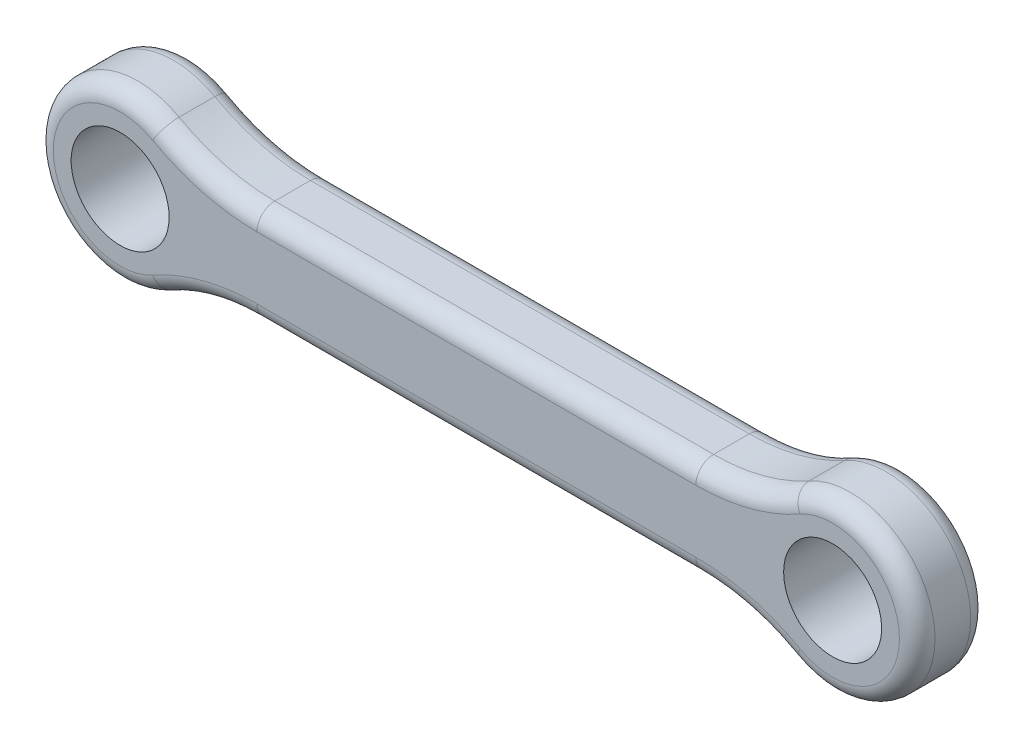
ISO-10303-21;
HEADER;
FILE_DESCRIPTION(('STEP AP214'),'2;1');
FILE_NAME('part.step','',(''),(''),'','','');
FILE_SCHEMA(('AUTOMOTIVE_DESIGN { 1 0 10303 214 1 1 1 1 }'));
ENDSEC;
DATA;
#1=APPLICATION_CONTEXT('core data for automotive mechanical design processes');
#2=APPLICATION_PROTOCOL_DEFINITION('international standard','automotive_design',2000,#1);
#3=PRODUCT_CONTEXT('',#1,'mechanical');
#4=PRODUCT('Part','Part','',(#3));
#5=PRODUCT_RELATED_PRODUCT_CATEGORY('part','',(#4));
#6=PRODUCT_DEFINITION_FORMATION('','',#4);
#7=PRODUCT_DEFINITION_CONTEXT('part definition',#1,'design');
#8=PRODUCT_DEFINITION('design','',#6,#7);
#9=PRODUCT_DEFINITION_SHAPE('','',#8);
#10=(LENGTH_UNIT() NAMED_UNIT(*) SI_UNIT(.MILLI.,.METRE.));
#11=(NAMED_UNIT(*) PLANE_ANGLE_UNIT() SI_UNIT($,.RADIAN.));
#12=(NAMED_UNIT(*) SI_UNIT($,.STERADIAN.) SOLID_ANGLE_UNIT());
#13=UNCERTAINTY_MEASURE_WITH_UNIT(LENGTH_MEASURE(1.E-05),#10,'distance_accuracy_value','');
#14=(GEOMETRIC_REPRESENTATION_CONTEXT(3) GLOBAL_UNCERTAINTY_ASSIGNED_CONTEXT((#13)) GLOBAL_UNIT_ASSIGNED_CONTEXT((#10,
#11,#12)) REPRESENTATION_CONTEXT('',''));
#15=CARTESIAN_POINT('',(0.,0.,0.));
#16=DIRECTION('',(0.,0.,1.));
#17=DIRECTION('',(1.,0.,0.));
#18=AXIS2_PLACEMENT_3D('',#15,#16,#17);
#19=CARTESIAN_POINT('',(12.3188542521314,-13.75,4.));
#20=DIRECTION('',(0.,0.,-1.));
#21=DIRECTION('',(-1.,0.,0.));
#22=AXIS2_PLACEMENT_3D('',#19,#20,#21);
#23=PLANE('',#22);
#24=DIRECTION('',(1.,0.,0.));
#25=VECTOR('',#24,1.);
#26=CARTESIAN_POINT('',(-12.3188542521314,1.75,4.));
#27=LINE('',#26,#25);
#28=CARTESIAN_POINT('',(12.3188542521314,1.75,4.));
#29=VERTEX_POINT('',#28);
#30=CARTESIAN_POINT('',(-12.3188542521314,1.75,4.));
#31=VERTEX_POINT('',#30);
#32=EDGE_CURVE('E218',#29,#31,#27,.F.);
#33=ORIENTED_EDGE('',*,*,#32,.T.);
#34=CARTESIAN_POINT('',(-12.3188542521314,13.75,4.));
#35=DIRECTION('',(0.,0.,-1.));
#36=DIRECTION('',(-1.,0.,0.));
#37=AXIS2_PLACEMENT_3D('',#34,#35,#36);
#38=CIRCLE('',#37,12.);
#39=CARTESIAN_POINT('',(-18.171155774317,3.27380952380952,4.));
#40=VERTEX_POINT('',#39);
#41=EDGE_CURVE('E264',#31,#40,#38,.T.);
#42=ORIENTED_EDGE('',*,*,#41,.T.);
#43=CARTESIAN_POINT('',(-20.,0.,4.));
#44=DIRECTION('',(0.,0.,-1.));
#45=DIRECTION('',(-1.,0.,0.));
#46=AXIS2_PLACEMENT_3D('',#43,#44,#45);
#47=CIRCLE('',#46,3.75);
#48=CARTESIAN_POINT('',(-18.171155774317,-3.27380952380952,4.));
#49=VERTEX_POINT('',#48);
#50=EDGE_CURVE('E261',#40,#49,#47,.F.);
#51=ORIENTED_EDGE('',*,*,#50,.T.);
#52=CARTESIAN_POINT('',(-12.3188542521314,-13.75,4.));
#53=DIRECTION('',(0.,0.,-1.));
#54=DIRECTION('',(-1.,0.,0.));
#55=AXIS2_PLACEMENT_3D('',#52,#53,#54);
#56=CIRCLE('',#55,12.);
#57=CARTESIAN_POINT('',(-12.3188542521314,-1.75,4.));
#58=VERTEX_POINT('',#57);
#59=EDGE_CURVE('E258',#49,#58,#56,.T.);
#60=ORIENTED_EDGE('',*,*,#59,.T.);
#61=DIRECTION('',(1.,0.,0.));
#62=VECTOR('',#61,1.);
#63=CARTESIAN_POINT('',(12.3188542521314,-1.75,4.));
#64=LINE('',#63,#62);
#65=CARTESIAN_POINT('',(12.3188542521314,-1.75,4.));
#66=VERTEX_POINT('',#65);
#67=EDGE_CURVE('E255',#58,#66,#64,.T.);
#68=ORIENTED_EDGE('',*,*,#67,.T.);
#69=CARTESIAN_POINT('',(12.3188542521314,-13.75,4.));
#70=DIRECTION('',(0.,0.,-1.));
#71=DIRECTION('',(-1.,0.,0.));
#72=AXIS2_PLACEMENT_3D('',#69,#70,#71);
#73=CIRCLE('',#72,12.);
#74=CARTESIAN_POINT('',(18.171155774317,-3.27380952380952,4.));
#75=VERTEX_POINT('',#74);
#76=EDGE_CURVE('E252',#66,#75,#73,.T.);
#77=ORIENTED_EDGE('',*,*,#76,.T.);
#78=CARTESIAN_POINT('',(20.,0.,4.));
#79=DIRECTION('',(0.,0.,-1.));
#80=DIRECTION('',(-1.,0.,0.));
#81=AXIS2_PLACEMENT_3D('',#78,#79,#80);
#82=CIRCLE('',#81,3.75);
#83=CARTESIAN_POINT('',(18.171155774317,3.27380952380952,4.));
#84=VERTEX_POINT('',#83);
#85=EDGE_CURVE('E221',#75,#84,#82,.F.);
#86=ORIENTED_EDGE('',*,*,#85,.T.);
#87=CARTESIAN_POINT('',(12.3188542521314,13.75,4.));
#88=DIRECTION('',(0.,0.,-1.));
#89=DIRECTION('',(-1.,0.,0.));
#90=AXIS2_PLACEMENT_3D('',#87,#88,#89);
#91=CIRCLE('',#90,12.);
#92=EDGE_CURVE('E213',#84,#29,#91,.T.);
#93=ORIENTED_EDGE('',*,*,#92,.T.);
#94=EDGE_LOOP('',(#33,#42,#51,#60,#68,#77,#86,#93));
#95=FACE_BOUND('',#94,.T.);
#96=CARTESIAN_POINT('',(20.,0.,4.));
#97=DIRECTION('',(0.,0.,-1.));
#98=DIRECTION('',(-1.,0.,0.));
#99=AXIS2_PLACEMENT_3D('',#96,#97,#98);
#100=CIRCLE('',#99,2.75);
#101=CARTESIAN_POINT('',(17.25,0.,4.));
#102=VERTEX_POINT('',#101);
#103=EDGE_CURVE('E713',#102,#102,#100,.T.);
#104=ORIENTED_EDGE('',*,*,#103,.T.);
#105=EDGE_LOOP('',(#104));
#106=FACE_BOUND('',#105,.T.);
#107=CARTESIAN_POINT('',(-20.,0.,4.));
#108=DIRECTION('',(0.,0.,1.));
#109=DIRECTION('',(1.,0.,0.));
#110=AXIS2_PLACEMENT_3D('',#107,#108,#109);
#111=CIRCLE('',#110,2.75);
#112=CARTESIAN_POINT('',(-17.25,0.,4.));
#113=VERTEX_POINT('',#112);
#114=EDGE_CURVE('E707',#113,#113,#111,.T.);
#115=ORIENTED_EDGE('',*,*,#114,.F.);
#116=EDGE_LOOP('',(#115));
#117=FACE_BOUND('',#116,.T.);
#118=ADVANCED_FACE('F99',(#95,#106,#117),#23,.F.);
#119=CARTESIAN_POINT('',(12.3188542521314,-13.75,0.));
#120=DIRECTION('',(0.,0.,-1.));
#121=DIRECTION('',(-1.,0.,0.));
#122=AXIS2_PLACEMENT_3D('',#119,#120,#121);
#123=PLANE('',#122);
#124=CARTESIAN_POINT('',(-20.,0.,0.));
#125=DIRECTION('',(0.,0.,-1.));
#126=DIRECTION('',(-1.,0.,0.));
#127=AXIS2_PLACEMENT_3D('',#124,#125,#126);
#128=CIRCLE('',#127,3.75);
#129=CARTESIAN_POINT('',(-18.171155774317,-3.27380952380952,0.));
#130=VERTEX_POINT('',#129);
#131=CARTESIAN_POINT('',(-18.171155774317,3.27380952380952,0.));
#132=VERTEX_POINT('',#131);
#133=EDGE_CURVE('E117',#130,#132,#128,.T.);
#134=ORIENTED_EDGE('',*,*,#133,.T.);
#135=CARTESIAN_POINT('',(-12.3188542521314,13.75,0.));
#136=DIRECTION('',(0.,0.,-1.));
#137=DIRECTION('',(-1.,0.,0.));
#138=AXIS2_PLACEMENT_3D('',#135,#136,#137);
#139=CIRCLE('',#138,12.);
#140=CARTESIAN_POINT('',(-12.3188542521314,1.75,0.));
#141=VERTEX_POINT('',#140);
#142=EDGE_CURVE('E329',#132,#141,#139,.F.);
#143=ORIENTED_EDGE('',*,*,#142,.T.);
#144=DIRECTION('',(1.,0.,0.));
#145=VECTOR('',#144,1.);
#146=CARTESIAN_POINT('',(12.3188542521314,1.75,0.));
#147=LINE('',#146,#145);
#148=CARTESIAN_POINT('',(12.3188542521314,1.75,0.));
#149=VERTEX_POINT('',#148);
#150=EDGE_CURVE('E310',#141,#149,#147,.T.);
#151=ORIENTED_EDGE('',*,*,#150,.T.);
#152=CARTESIAN_POINT('',(12.3188542521314,13.75,0.));
#153=DIRECTION('',(0.,0.,-1.));
#154=DIRECTION('',(-1.,0.,0.));
#155=AXIS2_PLACEMENT_3D('',#152,#153,#154);
#156=CIRCLE('',#155,12.);
#157=CARTESIAN_POINT('',(18.171155774317,3.27380952380952,0.));
#158=VERTEX_POINT('',#157);
#159=EDGE_CURVE('E313',#149,#158,#156,.F.);
#160=ORIENTED_EDGE('',*,*,#159,.T.);
#161=CARTESIAN_POINT('',(20.,0.,0.));
#162=DIRECTION('',(0.,0.,-1.));
#163=DIRECTION('',(-1.,0.,0.));
#164=AXIS2_PLACEMENT_3D('',#161,#162,#163);
#165=CIRCLE('',#164,3.75);
#166=CARTESIAN_POINT('',(18.171155774317,-3.27380952380952,0.));
#167=VERTEX_POINT('',#166);
#168=EDGE_CURVE('E316',#158,#167,#165,.T.);
#169=ORIENTED_EDGE('',*,*,#168,.T.);
#170=CARTESIAN_POINT('',(12.3188542521314,-13.75,0.));
#171=DIRECTION('',(0.,0.,-1.));
#172=DIRECTION('',(-1.,0.,0.));
#173=AXIS2_PLACEMENT_3D('',#170,#171,#172);
#174=CIRCLE('',#173,12.);
#175=CARTESIAN_POINT('',(12.3188542521314,-1.75,0.));
#176=VERTEX_POINT('',#175);
#177=EDGE_CURVE('E319',#167,#176,#174,.F.);
#178=ORIENTED_EDGE('',*,*,#177,.T.);
#179=DIRECTION('',(1.,0.,0.));
#180=VECTOR('',#179,1.);
#181=CARTESIAN_POINT('',(-12.3188542521314,-1.75,0.));
#182=LINE('',#181,#180);
#183=CARTESIAN_POINT('',(-12.3188542521314,-1.75,0.));
#184=VERTEX_POINT('',#183);
#185=EDGE_CURVE('E322',#176,#184,#182,.F.);
#186=ORIENTED_EDGE('',*,*,#185,.T.);
#187=CARTESIAN_POINT('',(-12.3188542521314,-13.75,0.));
#188=DIRECTION('',(0.,0.,-1.));
#189=DIRECTION('',(-1.,0.,0.));
#190=AXIS2_PLACEMENT_3D('',#187,#188,#189);
#191=CIRCLE('',#190,12.);
#192=EDGE_CURVE('E122',#184,#130,#191,.F.);
#193=ORIENTED_EDGE('',*,*,#192,.T.);
#194=EDGE_LOOP('',(#134,#143,#151,#160,#169,#178,#186,#193));
#195=FACE_BOUND('',#194,.T.);
#196=CARTESIAN_POINT('',(20.,0.,0.));
#197=DIRECTION('',(0.,0.,-1.));
#198=DIRECTION('',(-1.,0.,0.));
#199=AXIS2_PLACEMENT_3D('',#196,#197,#198);
#200=CIRCLE('',#199,2.75);
#201=CARTESIAN_POINT('',(17.25,0.,0.));
#202=VERTEX_POINT('',#201);
#203=EDGE_CURVE('E356',#202,#202,#200,.T.);
#204=ORIENTED_EDGE('',*,*,#203,.F.);
#205=EDGE_LOOP('',(#204));
#206=FACE_BOUND('',#205,.T.);
#207=CARTESIAN_POINT('',(-20.,0.,0.));
#208=DIRECTION('',(0.,0.,1.));
#209=DIRECTION('',(1.,0.,0.));
#210=AXIS2_PLACEMENT_3D('',#207,#208,#209);
#211=CIRCLE('',#210,2.75);
#212=CARTESIAN_POINT('',(-17.25,0.,0.));
#213=VERTEX_POINT('',#212);
#214=EDGE_CURVE('E710',#213,#213,#211,.T.);
#215=ORIENTED_EDGE('',*,*,#214,.T.);
#216=EDGE_LOOP('',(#215));
#217=FACE_BOUND('',#216,.T.);
#218=ADVANCED_FACE('F396',(#195,#206,#217),#123,.T.);
#219=CARTESIAN_POINT('',(-12.3188542521314,-2.75,4.));
#220=DIRECTION('',(0.,1.,0.));
#221=DIRECTION('',(0.,0.,1.));
#222=AXIS2_PLACEMENT_3D('',#219,#220,#221);
#223=PLANE('',#222);
#224=DIRECTION('',(0.,0.,-1.));
#225=VECTOR('',#224,1.);
#226=CARTESIAN_POINT('',(12.3188542521314,-2.75,4.));
#227=LINE('',#226,#225);
#228=CARTESIAN_POINT('',(12.3188542521314,-2.75,3.));
#229=VERTEX_POINT('',#228);
#230=CARTESIAN_POINT('',(12.3188542521314,-2.75,1.));
#231=VERTEX_POINT('',#230);
#232=EDGE_CURVE('E242',#229,#231,#227,.T.);
#233=ORIENTED_EDGE('',*,*,#232,.F.);
#234=DIRECTION('',(1.,0.,0.));
#235=VECTOR('',#234,1.);
#236=CARTESIAN_POINT('',(-12.3188542521314,-2.75,3.));
#237=LINE('',#236,#235);
#238=CARTESIAN_POINT('',(-12.3188542521314,-2.75,3.));
#239=VERTEX_POINT('',#238);
#240=EDGE_CURVE('E290',#229,#239,#237,.F.);
#241=ORIENTED_EDGE('',*,*,#240,.T.);
#242=DIRECTION('',(0.,0.,-1.));
#243=VECTOR('',#242,1.);
#244=CARTESIAN_POINT('',(-12.3188542521314,-2.75,4.));
#245=LINE('',#244,#243);
#246=CARTESIAN_POINT('',(-12.3188542521314,-2.75,1.));
#247=VERTEX_POINT('',#246);
#248=EDGE_CURVE('E717',#239,#247,#245,.T.);
#249=ORIENTED_EDGE('',*,*,#248,.T.);
#250=DIRECTION('',(1.,0.,0.));
#251=VECTOR('',#250,1.);
#252=CARTESIAN_POINT('',(12.3188542521314,-2.75,1.));
#253=LINE('',#252,#251);
#254=EDGE_CURVE('E287',#247,#231,#253,.T.);
#255=ORIENTED_EDGE('',*,*,#254,.T.);
#256=EDGE_LOOP('',(#233,#241,#249,#255));
#257=FACE_BOUND('',#256,.T.);
#258=ADVANCED_FACE('F472',(#257),#223,.F.);
#259=CARTESIAN_POINT('',(12.3188542521314,-13.75,4.));
#260=DIRECTION('',(0.,0.,-1.));
#261=DIRECTION('',(-1.,0.,0.));
#262=AXIS2_PLACEMENT_3D('',#259,#260,#261);
#263=CYLINDRICAL_SURFACE('',#262,11.);
#264=DIRECTION('',(0.,0.,-1.));
#265=VECTOR('',#264,1.);
#266=CARTESIAN_POINT('',(17.6834639808015,-4.1468253968254,4.));
#267=LINE('',#266,#265);
#268=CARTESIAN_POINT('',(17.6834639808015,-4.1468253968254,3.));
#269=VERTEX_POINT('',#268);
#270=CARTESIAN_POINT('',(17.6834639808015,-4.1468253968254,1.));
#271=VERTEX_POINT('',#270);
#272=EDGE_CURVE('E246',#269,#271,#267,.T.);
#273=ORIENTED_EDGE('',*,*,#272,.F.);
#274=CARTESIAN_POINT('',(12.3188542521314,-13.75,3.));
#275=DIRECTION('',(0.,0.,-1.));
#276=DIRECTION('',(-1.,0.,0.));
#277=AXIS2_PLACEMENT_3D('',#274,#275,#276);
#278=CIRCLE('',#277,11.);
#279=EDGE_CURVE('E296',#269,#229,#278,.F.);
#280=ORIENTED_EDGE('',*,*,#279,.T.);
#281=ORIENTED_EDGE('',*,*,#232,.T.);
#282=CARTESIAN_POINT('',(12.3188542521314,-13.75,1.));
#283=DIRECTION('',(0.,0.,-1.));
#284=DIRECTION('',(-1.,0.,0.));
#285=AXIS2_PLACEMENT_3D('',#282,#283,#284);
#286=CIRCLE('',#285,11.);
#287=EDGE_CURVE('E293',#231,#271,#286,.T.);
#288=ORIENTED_EDGE('',*,*,#287,.T.);
#289=EDGE_LOOP('',(#273,#280,#281,#288));
#290=FACE_BOUND('',#289,.T.);
#291=ADVANCED_FACE('F445',(#290),#263,.F.);
#292=CARTESIAN_POINT('',(20.,0.,4.));
#293=DIRECTION('',(0.,0.,-1.));
#294=DIRECTION('',(-1.,0.,0.));
#295=AXIS2_PLACEMENT_3D('',#292,#293,#294);
#296=CYLINDRICAL_SURFACE('',#295,4.75);
#297=DIRECTION('',(0.,0.,-1.));
#298=VECTOR('',#297,1.);
#299=CARTESIAN_POINT('',(17.6834639808015,4.1468253968254,4.));
#300=LINE('',#299,#298);
#301=CARTESIAN_POINT('',(17.6834639808015,4.1468253968254,3.));
#302=VERTEX_POINT('',#301);
#303=CARTESIAN_POINT('',(17.6834639808015,4.1468253968254,1.));
#304=VERTEX_POINT('',#303);
#305=EDGE_CURVE('E428',#302,#304,#300,.T.);
#306=ORIENTED_EDGE('',*,*,#305,.F.);
#307=CARTESIAN_POINT('',(20.,0.,3.));
#308=DIRECTION('',(0.,0.,-1.));
#309=DIRECTION('',(-1.,0.,0.));
#310=AXIS2_PLACEMENT_3D('',#307,#308,#309);
#311=CIRCLE('',#310,4.75);
#312=EDGE_CURVE('E302',#302,#269,#311,.T.);
#313=ORIENTED_EDGE('',*,*,#312,.T.);
#314=ORIENTED_EDGE('',*,*,#272,.T.);
#315=CARTESIAN_POINT('',(20.,0.,1.));
#316=DIRECTION('',(0.,0.,-1.));
#317=DIRECTION('',(-1.,0.,0.));
#318=AXIS2_PLACEMENT_3D('',#315,#316,#317);
#319=CIRCLE('',#318,4.75);
#320=EDGE_CURVE('E299',#271,#304,#319,.F.);
#321=ORIENTED_EDGE('',*,*,#320,.T.);
#322=EDGE_LOOP('',(#306,#313,#314,#321));
#323=FACE_BOUND('',#322,.T.);
#324=ADVANCED_FACE('F441',(#323),#296,.T.);
#325=CARTESIAN_POINT('',(12.3188542521314,13.75,4.));
#326=DIRECTION('',(0.,0.,-1.));
#327=DIRECTION('',(-1.,0.,0.));
#328=AXIS2_PLACEMENT_3D('',#325,#326,#327);
#329=CYLINDRICAL_SURFACE('',#328,11.);
#330=DIRECTION('',(0.,0.,-1.));
#331=VECTOR('',#330,1.);
#332=CARTESIAN_POINT('',(12.3188542521314,2.75,4.));
#333=LINE('',#332,#331);
#334=CARTESIAN_POINT('',(12.3188542521314,2.75,3.));
#335=VERTEX_POINT('',#334);
#336=CARTESIAN_POINT('',(12.3188542521314,2.75,1.));
#337=VERTEX_POINT('',#336);
#338=EDGE_CURVE('E417',#335,#337,#333,.T.);
#339=ORIENTED_EDGE('',*,*,#338,.F.);
#340=CARTESIAN_POINT('',(12.3188542521314,13.75,3.));
#341=DIRECTION('',(0.,0.,-1.));
#342=DIRECTION('',(-1.,0.,0.));
#343=AXIS2_PLACEMENT_3D('',#340,#341,#342);
#344=CIRCLE('',#343,11.);
#345=EDGE_CURVE('E231',#335,#302,#344,.F.);
#346=ORIENTED_EDGE('',*,*,#345,.T.);
#347=ORIENTED_EDGE('',*,*,#305,.T.);
#348=CARTESIAN_POINT('',(12.3188542521314,13.75,1.));
#349=DIRECTION('',(0.,0.,-1.));
#350=DIRECTION('',(-1.,0.,0.));
#351=AXIS2_PLACEMENT_3D('',#348,#349,#350);
#352=CIRCLE('',#351,11.);
#353=EDGE_CURVE('E305',#304,#337,#352,.T.);
#354=ORIENTED_EDGE('',*,*,#353,.T.);
#355=EDGE_LOOP('',(#339,#346,#347,#354));
#356=FACE_BOUND('',#355,.T.);
#357=ADVANCED_FACE('F490',(#356),#329,.F.);
#358=CARTESIAN_POINT('',(-12.3188542521314,2.75,4.));
#359=DIRECTION('',(0.,1.,0.));
#360=DIRECTION('',(0.,0.,1.));
#361=AXIS2_PLACEMENT_3D('',#358,#359,#360);
#362=PLANE('',#361);
#363=DIRECTION('',(0.,0.,-1.));
#364=VECTOR('',#363,1.);
#365=CARTESIAN_POINT('',(-12.3188542521314,2.75,4.));
#366=LINE('',#365,#364);
#367=CARTESIAN_POINT('',(-12.3188542521314,2.75,3.));
#368=VERTEX_POINT('',#367);
#369=CARTESIAN_POINT('',(-12.3188542521314,2.75,1.));
#370=VERTEX_POINT('',#369);
#371=EDGE_CURVE('E415',#368,#370,#366,.T.);
#372=ORIENTED_EDGE('',*,*,#371,.F.);
#373=DIRECTION('',(1.,0.,0.));
#374=VECTOR('',#373,1.);
#375=CARTESIAN_POINT('',(12.3188542521314,2.75,3.));
#376=LINE('',#375,#374);
#377=EDGE_CURVE('E12',#368,#335,#376,.T.);
#378=ORIENTED_EDGE('',*,*,#377,.T.);
#379=ORIENTED_EDGE('',*,*,#338,.T.);
#380=DIRECTION('',(1.,0.,0.));
#381=VECTOR('',#380,1.);
#382=CARTESIAN_POINT('',(-12.3188542521314,2.75,1.));
#383=LINE('',#382,#381);
#384=EDGE_CURVE('E109',#337,#370,#383,.F.);
#385=ORIENTED_EDGE('',*,*,#384,.T.);
#386=EDGE_LOOP('',(#372,#378,#379,#385));
#387=FACE_BOUND('',#386,.T.);
#388=ADVANCED_FACE('F414',(#387),#362,.T.);
#389=CARTESIAN_POINT('',(-12.3188542521314,13.75,4.));
#390=DIRECTION('',(0.,0.,-1.));
#391=DIRECTION('',(-1.,0.,0.));
#392=AXIS2_PLACEMENT_3D('',#389,#390,#391);
#393=CYLINDRICAL_SURFACE('',#392,11.);
#394=DIRECTION('',(0.,0.,-1.));
#395=VECTOR('',#394,1.);
#396=CARTESIAN_POINT('',(-17.6834639808015,4.1468253968254,4.));
#397=LINE('',#396,#395);
#398=CARTESIAN_POINT('',(-17.6834639808015,4.1468253968254,3.));
#399=VERTEX_POINT('',#398);
#400=CARTESIAN_POINT('',(-17.6834639808015,4.1468253968254,1.));
#401=VERTEX_POINT('',#400);
#402=EDGE_CURVE('E424',#399,#401,#397,.T.);
#403=ORIENTED_EDGE('',*,*,#402,.F.);
#404=CARTESIAN_POINT('',(-12.3188542521314,13.75,3.));
#405=DIRECTION('',(0.,0.,-1.));
#406=DIRECTION('',(-1.,0.,0.));
#407=AXIS2_PLACEMENT_3D('',#404,#405,#406);
#408=CIRCLE('',#407,11.);
#409=EDGE_CURVE('E271',#399,#368,#408,.F.);
#410=ORIENTED_EDGE('',*,*,#409,.T.);
#411=ORIENTED_EDGE('',*,*,#371,.T.);
#412=CARTESIAN_POINT('',(-12.3188542521314,13.75,1.));
#413=DIRECTION('',(0.,0.,-1.));
#414=DIRECTION('',(-1.,0.,0.));
#415=AXIS2_PLACEMENT_3D('',#412,#413,#414);
#416=CIRCLE('',#415,11.);
#417=EDGE_CURVE('E267',#370,#401,#416,.T.);
#418=ORIENTED_EDGE('',*,*,#417,.T.);
#419=EDGE_LOOP('',(#403,#410,#411,#418));
#420=FACE_BOUND('',#419,.T.);
#421=ADVANCED_FACE('F420',(#420),#393,.F.);
#422=CARTESIAN_POINT('',(-20.,0.,4.));
#423=DIRECTION('',(0.,0.,-1.));
#424=DIRECTION('',(-1.,0.,0.));
#425=AXIS2_PLACEMENT_3D('',#422,#423,#424);
#426=CYLINDRICAL_SURFACE('',#425,4.75);
#427=DIRECTION('',(0.,0.,-1.));
#428=VECTOR('',#427,1.);
#429=CARTESIAN_POINT('',(-17.6834639808015,-4.1468253968254,4.));
#430=LINE('',#429,#428);
#431=CARTESIAN_POINT('',(-17.6834639808015,-4.1468253968254,3.));
#432=VERTEX_POINT('',#431);
#433=CARTESIAN_POINT('',(-17.6834639808015,-4.1468253968254,1.));
#434=VERTEX_POINT('',#433);
#435=EDGE_CURVE('E430',#432,#434,#430,.T.);
#436=ORIENTED_EDGE('',*,*,#435,.F.);
#437=CARTESIAN_POINT('',(-20.,0.,3.));
#438=DIRECTION('',(0.,0.,-1.));
#439=DIRECTION('',(-1.,0.,0.));
#440=AXIS2_PLACEMENT_3D('',#437,#438,#439);
#441=CIRCLE('',#440,4.75);
#442=EDGE_CURVE('E278',#432,#399,#441,.T.);
#443=ORIENTED_EDGE('',*,*,#442,.T.);
#444=ORIENTED_EDGE('',*,*,#402,.T.);
#445=CARTESIAN_POINT('',(-20.,0.,1.));
#446=DIRECTION('',(0.,0.,-1.));
#447=DIRECTION('',(-1.,0.,0.));
#448=AXIS2_PLACEMENT_3D('',#445,#446,#447);
#449=CIRCLE('',#448,4.75);
#450=EDGE_CURVE('E275',#401,#434,#449,.F.);
#451=ORIENTED_EDGE('',*,*,#450,.T.);
#452=EDGE_LOOP('',(#436,#443,#444,#451));
#453=FACE_BOUND('',#452,.T.);
#454=ADVANCED_FACE('F481',(#453),#426,.T.);
#455=CARTESIAN_POINT('',(-12.3188542521314,-13.75,4.));
#456=DIRECTION('',(0.,0.,-1.));
#457=DIRECTION('',(-1.,0.,0.));
#458=AXIS2_PLACEMENT_3D('',#455,#456,#457);
#459=CYLINDRICAL_SURFACE('',#458,11.);
#460=ORIENTED_EDGE('',*,*,#248,.F.);
#461=CARTESIAN_POINT('',(-12.3188542521314,-13.75,3.));
#462=DIRECTION('',(0.,0.,-1.));
#463=DIRECTION('',(-1.,0.,0.));
#464=AXIS2_PLACEMENT_3D('',#461,#462,#463);
#465=CIRCLE('',#464,11.);
#466=EDGE_CURVE('E284',#239,#432,#465,.F.);
#467=ORIENTED_EDGE('',*,*,#466,.T.);
#468=ORIENTED_EDGE('',*,*,#435,.T.);
#469=CARTESIAN_POINT('',(-12.3188542521314,-13.75,1.));
#470=DIRECTION('',(0.,0.,-1.));
#471=DIRECTION('',(-1.,0.,0.));
#472=AXIS2_PLACEMENT_3D('',#469,#470,#471);
#473=CIRCLE('',#472,11.);
#474=EDGE_CURVE('E281',#434,#247,#473,.T.);
#475=ORIENTED_EDGE('',*,*,#474,.T.);
#476=EDGE_LOOP('',(#460,#467,#468,#475));
#477=FACE_BOUND('',#476,.T.);
#478=ADVANCED_FACE('F478',(#477),#459,.F.);
#479=CARTESIAN_POINT('',(-20.,0.,4.));
#480=DIRECTION('',(0.,0.,-1.));
#481=DIRECTION('',(-1.,0.,0.));
#482=AXIS2_PLACEMENT_3D('',#479,#480,#481);
#483=CYLINDRICAL_SURFACE('',#482,2.75);
#484=ORIENTED_EDGE('',*,*,#114,.T.);
#485=EDGE_LOOP('',(#484));
#486=FACE_BOUND('',#485,.T.);
#487=ORIENTED_EDGE('',*,*,#214,.F.);
#488=EDGE_LOOP('',(#487));
#489=FACE_BOUND('',#488,.T.);
#490=ADVANCED_FACE('F475',(#486,#489),#483,.F.);
#491=CARTESIAN_POINT('',(20.,0.,4.));
#492=DIRECTION('',(0.,0.,-1.));
#493=DIRECTION('',(-1.,0.,0.));
#494=AXIS2_PLACEMENT_3D('',#491,#492,#493);
#495=CYLINDRICAL_SURFACE('',#494,2.75);
#496=ORIENTED_EDGE('',*,*,#103,.F.);
#497=EDGE_LOOP('',(#496));
#498=FACE_BOUND('',#497,.T.);
#499=ORIENTED_EDGE('',*,*,#203,.T.);
#500=EDGE_LOOP('',(#499));
#501=FACE_BOUND('',#500,.T.);
#502=ADVANCED_FACE('F464',(#498,#501),#495,.F.);
#503=CARTESIAN_POINT('',(12.3188542521314,-13.75,3.));
#504=DIRECTION('',(0.,0.,-1.));
#505=DIRECTION('',(-1.,0.,0.));
#506=AXIS2_PLACEMENT_3D('',#503,#504,#505);
#507=TOROIDAL_SURFACE('',#506,12.,1.);
#508=CARTESIAN_POINT('',(12.3188542521314,-1.75,3.));
#509=DIRECTION('',(-1.,0.,0.));
#510=DIRECTION('',(0.,0.,1.));
#511=AXIS2_PLACEMENT_3D('',#508,#509,#510);
#512=CIRCLE('',#511,1.);
#513=EDGE_CURVE('E348',#229,#66,#512,.T.);
#514=ORIENTED_EDGE('',*,*,#513,.F.);
#515=ORIENTED_EDGE('',*,*,#279,.F.);
#516=CARTESIAN_POINT('',(18.171155774317,-3.27380952380952,3.));
#517=DIRECTION('',(0.873015873015873,-0.487691793515467,0.));
#518=DIRECTION('',(0.487691793515467,0.873015873015873,0.));
#519=AXIS2_PLACEMENT_3D('',#516,#517,#518);
#520=CIRCLE('',#519,1.);
#521=EDGE_CURVE('E352',#75,#269,#520,.T.);
#522=ORIENTED_EDGE('',*,*,#521,.F.);
#523=ORIENTED_EDGE('',*,*,#76,.F.);
#524=EDGE_LOOP('',(#514,#515,#522,#523));
#525=FACE_BOUND('',#524,.T.);
#526=ADVANCED_FACE('F450',(#525),#507,.T.);
#527=CARTESIAN_POINT('',(20.,0.,3.));
#528=DIRECTION('',(0.,0.,-1.));
#529=DIRECTION('',(-1.,0.,0.));
#530=AXIS2_PLACEMENT_3D('',#527,#528,#529);
#531=TOROIDAL_SURFACE('',#530,3.75,1.);
#532=ORIENTED_EDGE('',*,*,#521,.T.);
#533=ORIENTED_EDGE('',*,*,#312,.F.);
#534=CARTESIAN_POINT('',(18.171155774317,3.27380952380952,3.));
#535=DIRECTION('',(-0.873015873015873,-0.487691793515467,0.));
#536=DIRECTION('',(0.487691793515467,-0.873015873015873,0.));
#537=AXIS2_PLACEMENT_3D('',#534,#535,#536);
#538=CIRCLE('',#537,1.);
#539=EDGE_CURVE('E345',#84,#302,#538,.T.);
#540=ORIENTED_EDGE('',*,*,#539,.F.);
#541=ORIENTED_EDGE('',*,*,#85,.F.);
#542=EDGE_LOOP('',(#532,#533,#540,#541));
#543=FACE_BOUND('',#542,.T.);
#544=ADVANCED_FACE('F454',(#543),#531,.T.);
#545=CARTESIAN_POINT('',(12.3188542521314,-1.75,3.));
#546=DIRECTION('',(1.,0.,0.));
#547=DIRECTION('',(0.,0.,-1.));
#548=AXIS2_PLACEMENT_3D('',#545,#546,#547);
#549=CYLINDRICAL_SURFACE('',#548,1.);
#550=ORIENTED_EDGE('',*,*,#513,.T.);
#551=ORIENTED_EDGE('',*,*,#67,.F.);
#552=CARTESIAN_POINT('',(-12.3188542521314,-1.75,3.));
#553=DIRECTION('',(-1.,0.,0.));
#554=DIRECTION('',(0.,0.,1.));
#555=AXIS2_PLACEMENT_3D('',#552,#553,#554);
#556=CIRCLE('',#555,1.);
#557=EDGE_CURVE('E235',#239,#58,#556,.T.);
#558=ORIENTED_EDGE('',*,*,#557,.F.);
#559=ORIENTED_EDGE('',*,*,#240,.F.);
#560=EDGE_LOOP('',(#550,#551,#558,#559));
#561=FACE_BOUND('',#560,.T.);
#562=ADVANCED_FACE('F456',(#561),#549,.T.);
#563=CARTESIAN_POINT('',(12.3188542521314,13.75,3.));
#564=DIRECTION('',(0.,0.,-1.));
#565=DIRECTION('',(-1.,0.,0.));
#566=AXIS2_PLACEMENT_3D('',#563,#564,#565);
#567=TOROIDAL_SURFACE('',#566,12.,1.);
#568=ORIENTED_EDGE('',*,*,#539,.T.);
#569=ORIENTED_EDGE('',*,*,#345,.F.);
#570=CARTESIAN_POINT('',(12.3188542521314,1.75,3.));
#571=DIRECTION('',(-1.,0.,0.));
#572=DIRECTION('',(0.,0.,1.));
#573=AXIS2_PLACEMENT_3D('',#570,#571,#572);
#574=CIRCLE('',#573,1.);
#575=EDGE_CURVE('E229',#29,#335,#574,.T.);
#576=ORIENTED_EDGE('',*,*,#575,.F.);
#577=ORIENTED_EDGE('',*,*,#92,.F.);
#578=EDGE_LOOP('',(#568,#569,#576,#577));
#579=FACE_BOUND('',#578,.T.);
#580=ADVANCED_FACE('F230',(#579),#567,.T.);
#581=CARTESIAN_POINT('',(-12.3188542521314,-13.75,3.));
#582=DIRECTION('',(0.,0.,-1.));
#583=DIRECTION('',(-1.,0.,0.));
#584=AXIS2_PLACEMENT_3D('',#581,#582,#583);
#585=TOROIDAL_SURFACE('',#584,12.,1.);
#586=ORIENTED_EDGE('',*,*,#557,.T.);
#587=ORIENTED_EDGE('',*,*,#59,.F.);
#588=CARTESIAN_POINT('',(-18.171155774317,-3.27380952380953,3.));
#589=DIRECTION('',(-0.873015873015873,-0.487691793515467,0.));
#590=DIRECTION('',(0.487691793515467,-0.873015873015873,0.));
#591=AXIS2_PLACEMENT_3D('',#588,#589,#590);
#592=CIRCLE('',#591,1.);
#593=EDGE_CURVE('E236',#432,#49,#592,.T.);
#594=ORIENTED_EDGE('',*,*,#593,.F.);
#595=ORIENTED_EDGE('',*,*,#466,.F.);
#596=EDGE_LOOP('',(#586,#587,#594,#595));
#597=FACE_BOUND('',#596,.T.);
#598=ADVANCED_FACE('F511',(#597),#585,.T.);
#599=CARTESIAN_POINT('',(-12.3188542521314,1.75,3.));
#600=DIRECTION('',(-1.,0.,0.));
#601=DIRECTION('',(0.,0.,1.));
#602=AXIS2_PLACEMENT_3D('',#599,#600,#601);
#603=CYLINDRICAL_SURFACE('',#602,1.);
#604=ORIENTED_EDGE('',*,*,#575,.T.);
#605=ORIENTED_EDGE('',*,*,#377,.F.);
#606=CARTESIAN_POINT('',(-12.3188542521314,1.75,3.));
#607=DIRECTION('',(-1.,0.,0.));
#608=DIRECTION('',(0.,0.,1.));
#609=AXIS2_PLACEMENT_3D('',#606,#607,#608);
#610=CIRCLE('',#609,1.);
#611=EDGE_CURVE('E239',#31,#368,#610,.T.);
#612=ORIENTED_EDGE('',*,*,#611,.F.);
#613=ORIENTED_EDGE('',*,*,#32,.F.);
#614=EDGE_LOOP('',(#604,#605,#612,#613));
#615=FACE_BOUND('',#614,.T.);
#616=ADVANCED_FACE('F238',(#615),#603,.T.);
#617=CARTESIAN_POINT('',(-20.,0.,3.));
#618=DIRECTION('',(0.,0.,-1.));
#619=DIRECTION('',(-1.,0.,0.));
#620=AXIS2_PLACEMENT_3D('',#617,#618,#619);
#621=TOROIDAL_SURFACE('',#620,3.75,1.);
#622=ORIENTED_EDGE('',*,*,#593,.T.);
#623=ORIENTED_EDGE('',*,*,#50,.F.);
#624=CARTESIAN_POINT('',(-18.171155774317,3.27380952380952,3.));
#625=DIRECTION('',(0.873015873015873,-0.487691793515467,0.));
#626=DIRECTION('',(0.487691793515467,0.873015873015873,0.));
#627=AXIS2_PLACEMENT_3D('',#624,#625,#626);
#628=CIRCLE('',#627,1.);
#629=EDGE_CURVE('E334',#399,#40,#628,.T.);
#630=ORIENTED_EDGE('',*,*,#629,.F.);
#631=ORIENTED_EDGE('',*,*,#442,.F.);
#632=EDGE_LOOP('',(#622,#623,#630,#631));
#633=FACE_BOUND('',#632,.T.);
#634=ADVANCED_FACE('F504',(#633),#621,.T.);
#635=CARTESIAN_POINT('',(-12.3188542521314,13.75,3.));
#636=DIRECTION('',(0.,0.,-1.));
#637=DIRECTION('',(-1.,0.,0.));
#638=AXIS2_PLACEMENT_3D('',#635,#636,#637);
#639=TOROIDAL_SURFACE('',#638,12.,1.);
#640=ORIENTED_EDGE('',*,*,#611,.T.);
#641=ORIENTED_EDGE('',*,*,#409,.F.);
#642=ORIENTED_EDGE('',*,*,#629,.T.);
#643=ORIENTED_EDGE('',*,*,#41,.F.);
#644=EDGE_LOOP('',(#640,#641,#642,#643));
#645=FACE_BOUND('',#644,.T.);
#646=ADVANCED_FACE('F501',(#645),#639,.T.);
#647=CARTESIAN_POINT('',(12.3188542521314,-13.75,1.));
#648=DIRECTION('',(0.,0.,-1.));
#649=DIRECTION('',(-1.,0.,0.));
#650=AXIS2_PLACEMENT_3D('',#647,#648,#649);
#651=TOROIDAL_SURFACE('',#650,12.,1.);
#652=CARTESIAN_POINT('',(12.3188542521314,-1.75,1.));
#653=DIRECTION('',(-1.,0.,0.));
#654=DIRECTION('',(0.,0.,1.));
#655=AXIS2_PLACEMENT_3D('',#652,#653,#654);
#656=CIRCLE('',#655,1.);
#657=EDGE_CURVE('E378',#176,#231,#656,.T.);
#658=ORIENTED_EDGE('',*,*,#657,.F.);
#659=ORIENTED_EDGE('',*,*,#177,.F.);
#660=CARTESIAN_POINT('',(18.171155774317,-3.27380952380952,1.));
#661=DIRECTION('',(0.873015873015873,-0.487691793515467,0.));
#662=DIRECTION('',(0.487691793515467,0.873015873015873,0.));
#663=AXIS2_PLACEMENT_3D('',#660,#661,#662);
#664=CIRCLE('',#663,1.);
#665=EDGE_CURVE('E103',#271,#167,#664,.T.);
#666=ORIENTED_EDGE('',*,*,#665,.F.);
#667=ORIENTED_EDGE('',*,*,#287,.F.);
#668=EDGE_LOOP('',(#658,#659,#666,#667));
#669=FACE_BOUND('',#668,.T.);
#670=ADVANCED_FACE('F101',(#669),#651,.T.);
#671=CARTESIAN_POINT('',(20.,0.,1.));
#672=DIRECTION('',(0.,0.,-1.));
#673=DIRECTION('',(-1.,0.,0.));
#674=AXIS2_PLACEMENT_3D('',#671,#672,#673);
#675=TOROIDAL_SURFACE('',#674,3.75,1.);
#676=ORIENTED_EDGE('',*,*,#665,.T.);
#677=ORIENTED_EDGE('',*,*,#168,.F.);
#678=CARTESIAN_POINT('',(18.171155774317,3.27380952380952,1.));
#679=DIRECTION('',(-0.873015873015873,-0.487691793515467,0.));
#680=DIRECTION('',(0.487691793515467,-0.873015873015873,0.));
#681=AXIS2_PLACEMENT_3D('',#678,#679,#680);
#682=CIRCLE('',#681,1.);
#683=EDGE_CURVE('E375',#304,#158,#682,.T.);
#684=ORIENTED_EDGE('',*,*,#683,.F.);
#685=ORIENTED_EDGE('',*,*,#320,.F.);
#686=EDGE_LOOP('',(#676,#677,#684,#685));
#687=FACE_BOUND('',#686,.T.);
#688=ADVANCED_FACE('F391',(#687),#675,.T.);
#689=CARTESIAN_POINT('',(-12.3188542521314,-1.75,1.));
#690=DIRECTION('',(-1.,0.,0.));
#691=DIRECTION('',(0.,0.,1.));
#692=AXIS2_PLACEMENT_3D('',#689,#690,#691);
#693=CYLINDRICAL_SURFACE('',#692,1.);
#694=ORIENTED_EDGE('',*,*,#657,.T.);
#695=ORIENTED_EDGE('',*,*,#254,.F.);
#696=CARTESIAN_POINT('',(-12.3188542521314,-1.75,1.));
#697=DIRECTION('',(-1.,0.,0.));
#698=DIRECTION('',(0.,0.,1.));
#699=AXIS2_PLACEMENT_3D('',#696,#697,#698);
#700=CIRCLE('',#699,1.);
#701=EDGE_CURVE('E371',#184,#247,#700,.T.);
#702=ORIENTED_EDGE('',*,*,#701,.F.);
#703=ORIENTED_EDGE('',*,*,#185,.F.);
#704=EDGE_LOOP('',(#694,#695,#702,#703));
#705=FACE_BOUND('',#704,.T.);
#706=ADVANCED_FACE('F553',(#705),#693,.T.);
#707=CARTESIAN_POINT('',(12.3188542521314,13.75,1.));
#708=DIRECTION('',(0.,0.,-1.));
#709=DIRECTION('',(-1.,0.,0.));
#710=AXIS2_PLACEMENT_3D('',#707,#708,#709);
#711=TOROIDAL_SURFACE('',#710,12.,1.);
#712=ORIENTED_EDGE('',*,*,#683,.T.);
#713=ORIENTED_EDGE('',*,*,#159,.F.);
#714=CARTESIAN_POINT('',(12.3188542521314,1.75,1.));
#715=DIRECTION('',(-1.,0.,0.));
#716=DIRECTION('',(0.,0.,1.));
#717=AXIS2_PLACEMENT_3D('',#714,#715,#716);
#718=CIRCLE('',#717,1.);
#719=EDGE_CURVE('E367',#337,#149,#718,.T.);
#720=ORIENTED_EDGE('',*,*,#719,.F.);
#721=ORIENTED_EDGE('',*,*,#353,.F.);
#722=EDGE_LOOP('',(#712,#713,#720,#721));
#723=FACE_BOUND('',#722,.T.);
#724=ADVANCED_FACE('F403',(#723),#711,.T.);
#725=CARTESIAN_POINT('',(-12.3188542521314,-13.75,1.));
#726=DIRECTION('',(0.,0.,-1.));
#727=DIRECTION('',(-1.,0.,0.));
#728=AXIS2_PLACEMENT_3D('',#725,#726,#727);
#729=TOROIDAL_SURFACE('',#728,12.,1.);
#730=ORIENTED_EDGE('',*,*,#701,.T.);
#731=ORIENTED_EDGE('',*,*,#474,.F.);
#732=CARTESIAN_POINT('',(-18.171155774317,-3.27380952380952,1.));
#733=DIRECTION('',(-0.873015873015873,-0.487691793515466,0.));
#734=DIRECTION('',(0.487691793515466,-0.873015873015873,0.));
#735=AXIS2_PLACEMENT_3D('',#732,#733,#734);
#736=CIRCLE('',#735,1.);
#737=EDGE_CURVE('E363',#130,#434,#736,.T.);
#738=ORIENTED_EDGE('',*,*,#737,.F.);
#739=ORIENTED_EDGE('',*,*,#192,.F.);
#740=EDGE_LOOP('',(#730,#731,#738,#739));
#741=FACE_BOUND('',#740,.T.);
#742=ADVANCED_FACE('F567',(#741),#729,.T.);
#743=CARTESIAN_POINT('',(12.3188542521314,1.75,1.));
#744=DIRECTION('',(1.,0.,0.));
#745=DIRECTION('',(0.,0.,-1.));
#746=AXIS2_PLACEMENT_3D('',#743,#744,#745);
#747=CYLINDRICAL_SURFACE('',#746,1.);
#748=ORIENTED_EDGE('',*,*,#719,.T.);
#749=ORIENTED_EDGE('',*,*,#150,.F.);
#750=CARTESIAN_POINT('',(-12.3188542521314,1.75,1.));
#751=DIRECTION('',(-1.,0.,0.));
#752=DIRECTION('',(0.,0.,1.));
#753=AXIS2_PLACEMENT_3D('',#750,#751,#752);
#754=CIRCLE('',#753,1.);
#755=EDGE_CURVE('E360',#370,#141,#754,.T.);
#756=ORIENTED_EDGE('',*,*,#755,.F.);
#757=ORIENTED_EDGE('',*,*,#384,.F.);
#758=EDGE_LOOP('',(#748,#749,#756,#757));
#759=FACE_BOUND('',#758,.T.);
#760=ADVANCED_FACE('F407',(#759),#747,.T.);
#761=CARTESIAN_POINT('',(-20.,0.,1.));
#762=DIRECTION('',(0.,0.,-1.));
#763=DIRECTION('',(-1.,0.,0.));
#764=AXIS2_PLACEMENT_3D('',#761,#762,#763);
#765=TOROIDAL_SURFACE('',#764,3.75,1.);
#766=ORIENTED_EDGE('',*,*,#737,.T.);
#767=ORIENTED_EDGE('',*,*,#450,.F.);
#768=CARTESIAN_POINT('',(-18.171155774317,3.27380952380952,1.));
#769=DIRECTION('',(0.873015873015873,-0.487691793515467,0.));
#770=DIRECTION('',(0.487691793515467,0.873015873015873,0.));
#771=AXIS2_PLACEMENT_3D('',#768,#769,#770);
#772=CIRCLE('',#771,1.);
#773=EDGE_CURVE('E357',#132,#401,#772,.T.);
#774=ORIENTED_EDGE('',*,*,#773,.F.);
#775=ORIENTED_EDGE('',*,*,#133,.F.);
#776=EDGE_LOOP('',(#766,#767,#774,#775));
#777=FACE_BOUND('',#776,.T.);
#778=ADVANCED_FACE('F583',(#777),#765,.T.);
#779=CARTESIAN_POINT('',(-12.3188542521314,13.75,1.));
#780=DIRECTION('',(0.,0.,-1.));
#781=DIRECTION('',(-1.,0.,0.));
#782=AXIS2_PLACEMENT_3D('',#779,#780,#781);
#783=TOROIDAL_SURFACE('',#782,12.,1.);
#784=ORIENTED_EDGE('',*,*,#755,.T.);
#785=ORIENTED_EDGE('',*,*,#142,.F.);
#786=ORIENTED_EDGE('',*,*,#773,.T.);
#787=ORIENTED_EDGE('',*,*,#417,.F.);
#788=EDGE_LOOP('',(#784,#785,#786,#787));
#789=FACE_BOUND('',#788,.T.);
#790=ADVANCED_FACE('F591',(#789),#783,.T.);
#791=CLOSED_SHELL('',(#118,#218,#258,#291,#324,#357,#388,#421,#454,#478,#490,#502,#526,#544,
#562,#580,#598,#616,#634,#646,#670,#688,#706,#724,#742,#760,#778,#790));
#792=MANIFOLD_SOLID_BREP('B2',#791);
#793=ADVANCED_BREP_SHAPE_REPRESENTATION('',(#18,#792),#14);
#794=SHAPE_DEFINITION_REPRESENTATION(#9,#793);
ENDSEC;
END-ISO-10303-21;
